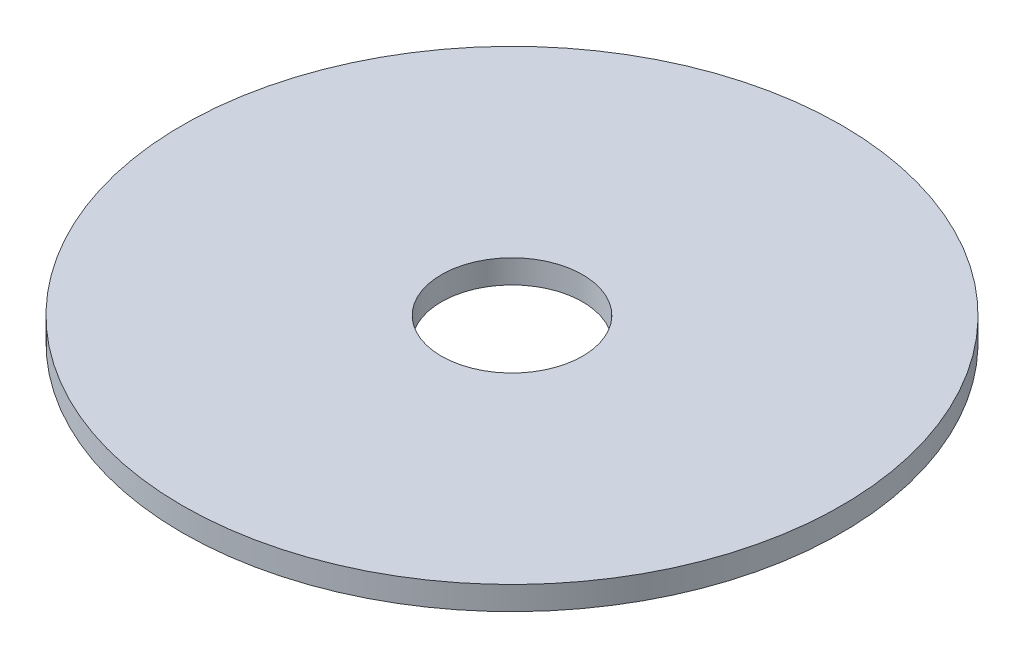
ISO-10303-21;
HEADER;
FILE_DESCRIPTION(('STEP AP214'),'2;1');
FILE_NAME('part.step','',(''),(''),'','','');
FILE_SCHEMA(('AUTOMOTIVE_DESIGN { 1 0 10303 214 1 1 1 1 }'));
ENDSEC;
DATA;
#1=APPLICATION_CONTEXT('core data for automotive mechanical design processes');
#2=APPLICATION_PROTOCOL_DEFINITION('international standard','automotive_design',2000,#1);
#3=PRODUCT_CONTEXT('',#1,'mechanical');
#4=PRODUCT('Part','Part','',(#3));
#5=PRODUCT_RELATED_PRODUCT_CATEGORY('part','',(#4));
#6=PRODUCT_DEFINITION_FORMATION('','',#4);
#7=PRODUCT_DEFINITION_CONTEXT('part definition',#1,'design');
#8=PRODUCT_DEFINITION('design','',#6,#7);
#9=PRODUCT_DEFINITION_SHAPE('','',#8);
#10=(LENGTH_UNIT() NAMED_UNIT(*) SI_UNIT(.MILLI.,.METRE.));
#11=(NAMED_UNIT(*) PLANE_ANGLE_UNIT() SI_UNIT($,.RADIAN.));
#12=(NAMED_UNIT(*) SI_UNIT($,.STERADIAN.) SOLID_ANGLE_UNIT());
#13=UNCERTAINTY_MEASURE_WITH_UNIT(LENGTH_MEASURE(1.E-05),#10,'distance_accuracy_value','');
#14=(GEOMETRIC_REPRESENTATION_CONTEXT(3) GLOBAL_UNCERTAINTY_ASSIGNED_CONTEXT((#13)) GLOBAL_UNIT_ASSIGNED_CONTEXT((#10,
#11,#12)) REPRESENTATION_CONTEXT('',''));
#15=CARTESIAN_POINT('',(0.,0.,0.));
#16=DIRECTION('',(0.,0.,1.));
#17=DIRECTION('',(1.,0.,0.));
#18=AXIS2_PLACEMENT_3D('',#15,#16,#17);
#19=CARTESIAN_POINT('',(0.,5.,0.));
#20=DIRECTION('',(0.,-1.,0.));
#21=DIRECTION('',(0.,0.,-1.));
#22=AXIS2_PLACEMENT_3D('',#19,#20,#21);
#23=CYLINDRICAL_SURFACE('',#22,70.);
#24=CARTESIAN_POINT('',(0.,5.,0.));
#25=DIRECTION('',(0.,1.,0.));
#26=DIRECTION('',(0.,0.,1.));
#27=AXIS2_PLACEMENT_3D('',#24,#25,#26);
#28=CIRCLE('',#27,70.);
#29=CARTESIAN_POINT('',(0.,5.,70.));
#30=VERTEX_POINT('',#29);
#31=EDGE_CURVE('E10',#30,#30,#28,.T.);
#32=ORIENTED_EDGE('',*,*,#31,.F.);
#33=EDGE_LOOP('',(#32));
#34=FACE_BOUND('',#33,.T.);
#35=CARTESIAN_POINT('',(0.,0.,0.));
#36=DIRECTION('',(0.,1.,0.));
#37=DIRECTION('',(0.,0.,1.));
#38=AXIS2_PLACEMENT_3D('',#35,#36,#37);
#39=CIRCLE('',#38,70.);
#40=CARTESIAN_POINT('',(0.,0.,70.));
#41=VERTEX_POINT('',#40);
#42=EDGE_CURVE('E37',#41,#41,#39,.T.);
#43=ORIENTED_EDGE('',*,*,#42,.T.);
#44=EDGE_LOOP('',(#43));
#45=FACE_BOUND('',#44,.T.);
#46=ADVANCED_FACE('F40',(#34,#45),#23,.T.);
#47=CARTESIAN_POINT('',(0.,5.,0.));
#48=DIRECTION('',(0.,1.,0.));
#49=DIRECTION('',(0.,0.,1.));
#50=AXIS2_PLACEMENT_3D('',#47,#48,#49);
#51=PLANE('',#50);
#52=CARTESIAN_POINT('',(0.,5.,0.));
#53=DIRECTION('',(0.,1.,0.));
#54=DIRECTION('',(0.,0.,1.));
#55=AXIS2_PLACEMENT_3D('',#52,#53,#54);
#56=CIRCLE('',#55,15.);
#57=CARTESIAN_POINT('',(0.,5.,15.));
#58=VERTEX_POINT('',#57);
#59=EDGE_CURVE('E50',#58,#58,#56,.T.);
#60=ORIENTED_EDGE('',*,*,#59,.F.);
#61=EDGE_LOOP('',(#60));
#62=FACE_BOUND('',#61,.T.);
#63=ORIENTED_EDGE('',*,*,#31,.T.);
#64=EDGE_LOOP('',(#63));
#65=FACE_BOUND('',#64,.T.);
#66=ADVANCED_FACE('F59',(#62,#65),#51,.T.);
#67=CARTESIAN_POINT('',(0.,0.,0.));
#68=DIRECTION('',(0.,1.,0.));
#69=DIRECTION('',(0.,0.,1.));
#70=AXIS2_PLACEMENT_3D('',#67,#68,#69);
#71=PLANE('',#70);
#72=CARTESIAN_POINT('',(0.,0.,0.));
#73=DIRECTION('',(0.,1.,0.));
#74=DIRECTION('',(0.,0.,1.));
#75=AXIS2_PLACEMENT_3D('',#72,#73,#74);
#76=CIRCLE('',#75,15.);
#77=CARTESIAN_POINT('',(0.,0.,15.));
#78=VERTEX_POINT('',#77);
#79=EDGE_CURVE('E47',#78,#78,#76,.T.);
#80=ORIENTED_EDGE('',*,*,#79,.T.);
#81=EDGE_LOOP('',(#80));
#82=FACE_BOUND('',#81,.T.);
#83=ORIENTED_EDGE('',*,*,#42,.F.);
#84=EDGE_LOOP('',(#83));
#85=FACE_BOUND('',#84,.T.);
#86=ADVANCED_FACE('F58',(#82,#85),#71,.F.);
#87=CARTESIAN_POINT('',(0.,5.,0.));
#88=DIRECTION('',(0.,-1.,0.));
#89=DIRECTION('',(0.,0.,-1.));
#90=AXIS2_PLACEMENT_3D('',#87,#88,#89);
#91=CYLINDRICAL_SURFACE('',#90,15.);
#92=ORIENTED_EDGE('',*,*,#59,.T.);
#93=EDGE_LOOP('',(#92));
#94=FACE_BOUND('',#93,.T.);
#95=ORIENTED_EDGE('',*,*,#79,.F.);
#96=EDGE_LOOP('',(#95));
#97=FACE_BOUND('',#96,.T.);
#98=ADVANCED_FACE('F54',(#94,#97),#91,.F.);
#99=CLOSED_SHELL('',(#46,#66,#86,#98));
#100=MANIFOLD_SOLID_BREP('B2',#99);
#101=ADVANCED_BREP_SHAPE_REPRESENTATION('',(#18,#100),#14);
#102=SHAPE_DEFINITION_REPRESENTATION(#9,#101);
ENDSEC;
END-ISO-10303-21;
